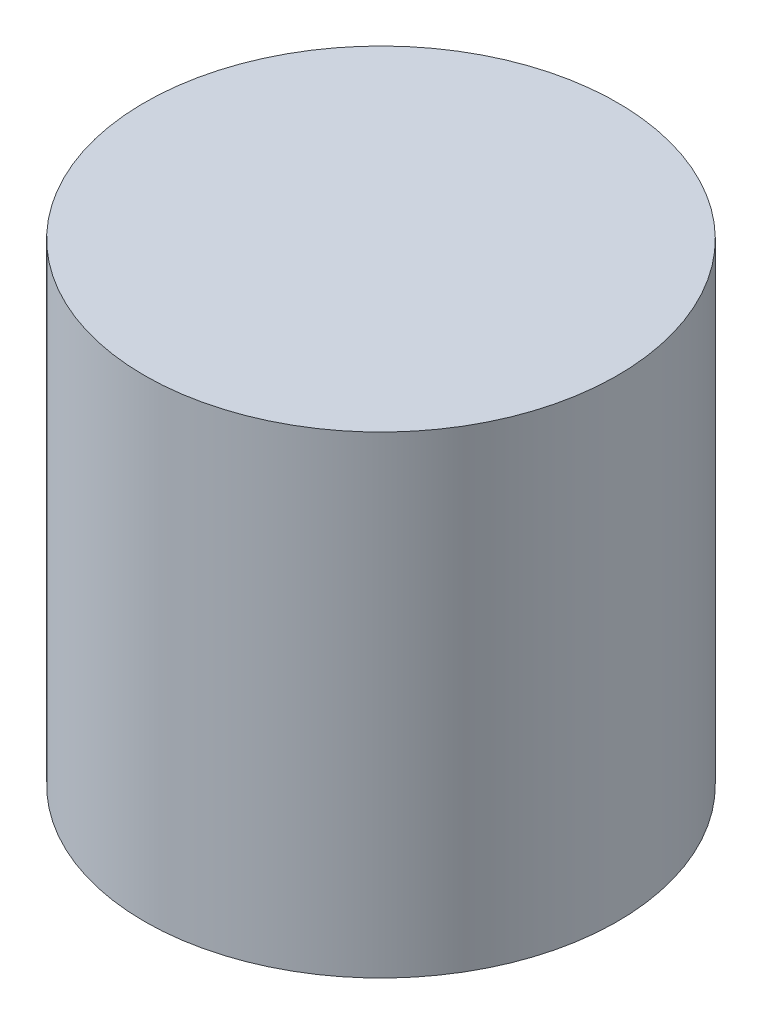
ISO-10303-21;
HEADER;
FILE_DESCRIPTION(('STEP AP214'),'2;1');
FILE_NAME('part.step','',(''),(''),'','','');
FILE_SCHEMA(('AUTOMOTIVE_DESIGN { 1 0 10303 214 1 1 1 1 }'));
ENDSEC;
DATA;
#1=APPLICATION_CONTEXT('core data for automotive mechanical design processes');
#2=APPLICATION_PROTOCOL_DEFINITION('international standard','automotive_design',2000,#1);
#3=PRODUCT_CONTEXT('',#1,'mechanical');
#4=PRODUCT('Part','Part','',(#3));
#5=PRODUCT_RELATED_PRODUCT_CATEGORY('part','',(#4));
#6=PRODUCT_DEFINITION_FORMATION('','',#4);
#7=PRODUCT_DEFINITION_CONTEXT('part definition',#1,'design');
#8=PRODUCT_DEFINITION('design','',#6,#7);
#9=PRODUCT_DEFINITION_SHAPE('','',#8);
#10=(LENGTH_UNIT() NAMED_UNIT(*) SI_UNIT(.MILLI.,.METRE.));
#11=(NAMED_UNIT(*) PLANE_ANGLE_UNIT() SI_UNIT($,.RADIAN.));
#12=(NAMED_UNIT(*) SI_UNIT($,.STERADIAN.) SOLID_ANGLE_UNIT());
#13=UNCERTAINTY_MEASURE_WITH_UNIT(LENGTH_MEASURE(1.E-05),#10,'distance_accuracy_value','');
#14=(GEOMETRIC_REPRESENTATION_CONTEXT(3) GLOBAL_UNCERTAINTY_ASSIGNED_CONTEXT((#13)) GLOBAL_UNIT_ASSIGNED_CONTEXT((#10,
#11,#12)) REPRESENTATION_CONTEXT('',''));
#15=CARTESIAN_POINT('',(0.,0.,0.));
#16=DIRECTION('',(0.,0.,1.));
#17=DIRECTION('',(1.,0.,0.));
#18=AXIS2_PLACEMENT_3D('',#15,#16,#17);
#19=CARTESIAN_POINT('',(0.,10.,0.));
#20=DIRECTION('',(0.,-1.,0.));
#21=DIRECTION('',(0.,0.,-1.));
#22=AXIS2_PLACEMENT_3D('',#19,#20,#21);
#23=CYLINDRICAL_SURFACE('',#22,5.);
#24=CARTESIAN_POINT('',(0.,10.,0.));
#25=DIRECTION('',(0.,1.,0.));
#26=DIRECTION('',(0.,0.,1.));
#27=AXIS2_PLACEMENT_3D('',#24,#25,#26);
#28=CIRCLE('',#27,5.);
#29=CARTESIAN_POINT('',(0.,10.,5.));
#30=VERTEX_POINT('',#29);
#31=EDGE_CURVE('E10',#30,#30,#28,.T.);
#32=ORIENTED_EDGE('',*,*,#31,.F.);
#33=EDGE_LOOP('',(#32));
#34=FACE_BOUND('',#33,.T.);
#35=CARTESIAN_POINT('',(0.,0.,0.));
#36=DIRECTION('',(0.,1.,0.));
#37=DIRECTION('',(0.,0.,1.));
#38=AXIS2_PLACEMENT_3D('',#35,#36,#37);
#39=CIRCLE('',#38,5.);
#40=CARTESIAN_POINT('',(0.,0.,5.));
#41=VERTEX_POINT('',#40);
#42=EDGE_CURVE('E38',#41,#41,#39,.T.);
#43=ORIENTED_EDGE('',*,*,#42,.T.);
#44=EDGE_LOOP('',(#43));
#45=FACE_BOUND('',#44,.T.);
#46=ADVANCED_FACE('F31',(#34,#45),#23,.T.);
#47=CARTESIAN_POINT('',(0.,10.,0.));
#48=DIRECTION('',(0.,1.,0.));
#49=DIRECTION('',(0.,0.,1.));
#50=AXIS2_PLACEMENT_3D('',#47,#48,#49);
#51=PLANE('',#50);
#52=ORIENTED_EDGE('',*,*,#31,.T.);
#53=EDGE_LOOP('',(#52));
#54=FACE_BOUND('',#53,.T.);
#55=ADVANCED_FACE('F73',(#54),#51,.T.);
#56=CARTESIAN_POINT('',(0.,0.,0.));
#57=DIRECTION('',(0.,1.,0.));
#58=DIRECTION('',(0.,0.,1.));
#59=AXIS2_PLACEMENT_3D('',#56,#57,#58);
#60=PLANE('',#59);
#61=CARTESIAN_POINT('',(0.,0.,0.));
#62=DIRECTION('',(0.,-1.,0.));
#63=DIRECTION('',(0.,0.,-1.));
#64=AXIS2_PLACEMENT_3D('',#61,#62,#63);
#65=CIRCLE('',#64,3.);
#66=CARTESIAN_POINT('',(0.,0.,-3.));
#67=VERTEX_POINT('',#66);
#68=EDGE_CURVE('E47',#67,#67,#65,.T.);
#69=ORIENTED_EDGE('',*,*,#68,.F.);
#70=EDGE_LOOP('',(#69));
#71=FACE_BOUND('',#70,.T.);
#72=ORIENTED_EDGE('',*,*,#42,.F.);
#73=EDGE_LOOP('',(#72));
#74=FACE_BOUND('',#73,.T.);
#75=ADVANCED_FACE('F78',(#71,#74),#60,.F.);
#76=CARTESIAN_POINT('',(0.,1.5,0.));
#77=DIRECTION('',(0.,-1.,0.));
#78=DIRECTION('',(0.,0.,-1.));
#79=AXIS2_PLACEMENT_3D('',#76,#77,#78);
#80=PLANE('',#79);
#81=CARTESIAN_POINT('',(0.,1.5,0.));
#82=DIRECTION('',(0.,-1.,0.));
#83=DIRECTION('',(0.,0.,-1.));
#84=AXIS2_PLACEMENT_3D('',#81,#82,#83);
#85=CIRCLE('',#84,3.);
#86=CARTESIAN_POINT('',(0.,1.5,-3.));
#87=VERTEX_POINT('',#86);
#88=EDGE_CURVE('E50',#87,#87,#85,.T.);
#89=ORIENTED_EDGE('',*,*,#88,.T.);
#90=EDGE_LOOP('',(#89));
#91=FACE_BOUND('',#90,.T.);
#92=CARTESIAN_POINT('',(0.,1.5,0.));
#93=DIRECTION('',(0.,-1.,0.));
#94=DIRECTION('',(0.,0.,-1.));
#95=AXIS2_PLACEMENT_3D('',#92,#93,#94);
#96=CIRCLE('',#95,2.5);
#97=CARTESIAN_POINT('',(0.,1.5,-2.5));
#98=VERTEX_POINT('',#97);
#99=EDGE_CURVE('E34',#98,#98,#96,.F.);
#100=ORIENTED_EDGE('',*,*,#99,.T.);
#101=EDGE_LOOP('',(#100));
#102=FACE_BOUND('',#101,.T.);
#103=ADVANCED_FACE('F57',(#91,#102),#80,.T.);
#104=CARTESIAN_POINT('',(0.,1.5,0.));
#105=DIRECTION('',(0.,-1.,0.));
#106=DIRECTION('',(0.,0.,-1.));
#107=AXIS2_PLACEMENT_3D('',#104,#105,#106);
#108=CYLINDRICAL_SURFACE('',#107,3.);
#109=ORIENTED_EDGE('',*,*,#88,.F.);
#110=EDGE_LOOP('',(#109));
#111=FACE_BOUND('',#110,.T.);
#112=ORIENTED_EDGE('',*,*,#68,.T.);
#113=EDGE_LOOP('',(#112));
#114=FACE_BOUND('',#113,.T.);
#115=ADVANCED_FACE('F67',(#111,#114),#108,.F.);
#116=CARTESIAN_POINT('',(0.,5.,0.));
#117=DIRECTION('',(0.,-1.,0.));
#118=DIRECTION('',(0.,0.,-1.));
#119=AXIS2_PLACEMENT_3D('',#116,#117,#118);
#120=PLANE('',#119);
#121=CARTESIAN_POINT('',(0.,5.,0.));
#122=DIRECTION('',(0.,-1.,0.));
#123=DIRECTION('',(0.,0.,-1.));
#124=AXIS2_PLACEMENT_3D('',#121,#122,#123);
#125=CIRCLE('',#124,2.5);
#126=CARTESIAN_POINT('',(0.,5.,-2.5));
#127=VERTEX_POINT('',#126);
#128=EDGE_CURVE('E43',#127,#127,#125,.T.);
#129=ORIENTED_EDGE('',*,*,#128,.T.);
#130=EDGE_LOOP('',(#129));
#131=FACE_BOUND('',#130,.T.);
#132=ADVANCED_FACE('F61',(#131),#120,.T.);
#133=CARTESIAN_POINT('',(0.,5.,0.));
#134=DIRECTION('',(0.,-1.,0.));
#135=DIRECTION('',(0.,0.,-1.));
#136=AXIS2_PLACEMENT_3D('',#133,#134,#135);
#137=CYLINDRICAL_SURFACE('',#136,2.5);
#138=ORIENTED_EDGE('',*,*,#128,.F.);
#139=EDGE_LOOP('',(#138));
#140=FACE_BOUND('',#139,.T.);
#141=ORIENTED_EDGE('',*,*,#99,.F.);
#142=EDGE_LOOP('',(#141));
#143=FACE_BOUND('',#142,.T.);
#144=ADVANCED_FACE('F59',(#140,#143),#137,.F.);
#145=CLOSED_SHELL('',(#46,#55,#75,#103,#115,#132,#144));
#146=MANIFOLD_SOLID_BREP('B2',#145);
#147=ADVANCED_BREP_SHAPE_REPRESENTATION('',(#18,#146),#14);
#148=SHAPE_DEFINITION_REPRESENTATION(#9,#147);
ENDSEC;
END-ISO-10303-21;
